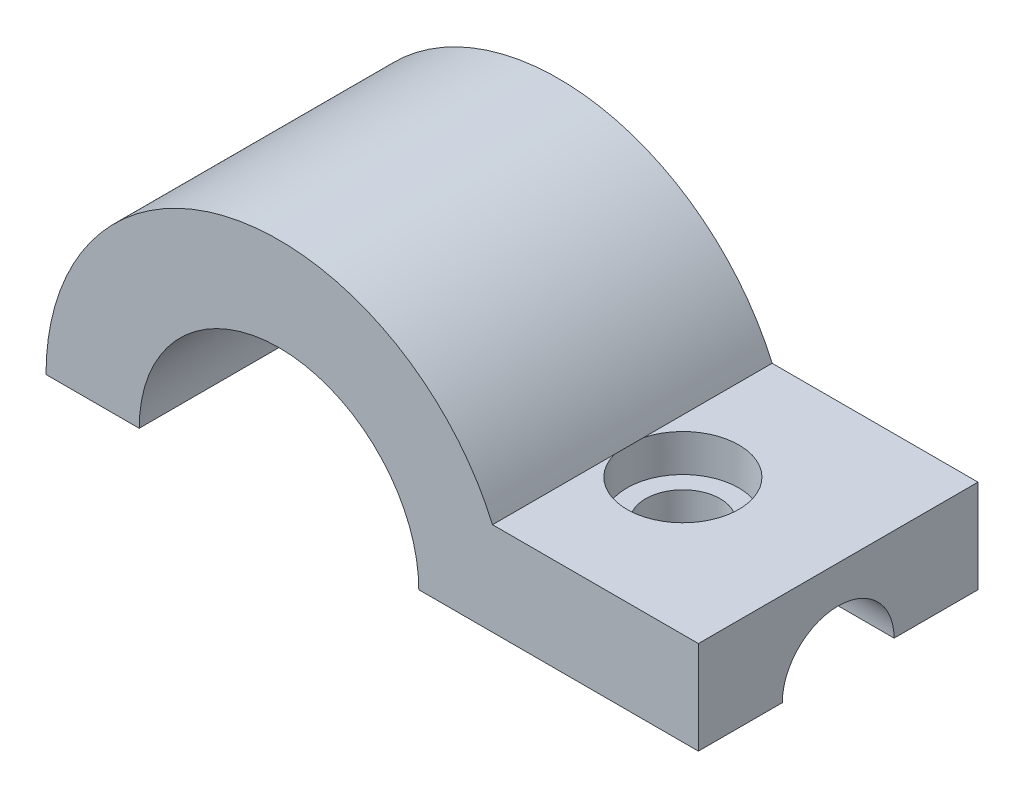
ISO-10303-21;
HEADER;
FILE_DESCRIPTION(('STEP AP214'),'2;1');
FILE_NAME('part.step','',(''),(''),'','','');
FILE_SCHEMA(('AUTOMOTIVE_DESIGN { 1 0 10303 214 1 1 1 1 }'));
ENDSEC;
DATA;
#1=APPLICATION_CONTEXT('core data for automotive mechanical design processes');
#2=APPLICATION_PROTOCOL_DEFINITION('international standard','automotive_design',2000,#1);
#3=PRODUCT_CONTEXT('',#1,'mechanical');
#4=PRODUCT('Part','Part','',(#3));
#5=PRODUCT_RELATED_PRODUCT_CATEGORY('part','',(#4));
#6=PRODUCT_DEFINITION_FORMATION('','',#4);
#7=PRODUCT_DEFINITION_CONTEXT('part definition',#1,'design');
#8=PRODUCT_DEFINITION('design','',#6,#7);
#9=PRODUCT_DEFINITION_SHAPE('','',#8);
#10=(LENGTH_UNIT() NAMED_UNIT(*) SI_UNIT(.MILLI.,.METRE.));
#11=(NAMED_UNIT(*) PLANE_ANGLE_UNIT() SI_UNIT($,.RADIAN.));
#12=(NAMED_UNIT(*) SI_UNIT($,.STERADIAN.) SOLID_ANGLE_UNIT());
#13=UNCERTAINTY_MEASURE_WITH_UNIT(LENGTH_MEASURE(1.E-05),#10,'distance_accuracy_value','');
#14=(GEOMETRIC_REPRESENTATION_CONTEXT(3) GLOBAL_UNCERTAINTY_ASSIGNED_CONTEXT((#13)) GLOBAL_UNIT_ASSIGNED_CONTEXT((#10,
#11,#12)) REPRESENTATION_CONTEXT('',''));
#15=CARTESIAN_POINT('',(0.,0.,0.));
#16=DIRECTION('',(0.,0.,1.));
#17=DIRECTION('',(1.,0.,0.));
#18=AXIS2_PLACEMENT_3D('',#15,#16,#17);
#19=CARTESIAN_POINT('',(-8.56480931815895,-1.,-0.731541815298442));
#20=DIRECTION('',(0.,1.,0.));
#21=DIRECTION('',(-1.,0.,0.));
#22=AXIS2_PLACEMENT_3D('',#19,#20,#21);
#23=CYLINDRICAL_SURFACE('',#22,0.200000000000001);
#24=CARTESIAN_POINT('',(-8.56480931815895,0.,-0.731541815298442));
#25=DIRECTION('',(0.,-1.,0.));
#26=DIRECTION('',(1.,0.,0.));
#27=AXIS2_PLACEMENT_3D('',#24,#25,#26);
#28=CIRCLE('',#27,0.200000000000001);
#29=CARTESIAN_POINT('',(-8.36480931815895,0.,-0.731541815298442));
#30=VERTEX_POINT('',#29);
#31=EDGE_CURVE('E138',#30,#30,#28,.T.);
#32=ORIENTED_EDGE('',*,*,#31,.T.);
#33=EDGE_LOOP('',(#32));
#34=FACE_BOUND('',#33,.T.);
#35=CARTESIAN_POINT('',(-8.56480931815895,0.3,-0.731541815298442));
#36=DIRECTION('',(0.,1.,0.));
#37=DIRECTION('',(-1.,0.,0.));
#38=AXIS2_PLACEMENT_3D('',#35,#36,#37);
#39=CIRCLE('',#38,0.200000000000001);
#40=CARTESIAN_POINT('',(-8.76480931815895,0.3,-0.731541815298442));
#41=VERTEX_POINT('',#40);
#42=EDGE_CURVE('E35',#41,#41,#39,.F.);
#43=ORIENTED_EDGE('',*,*,#42,.F.);
#44=EDGE_LOOP('',(#43));
#45=FACE_BOUND('',#44,.T.);
#46=ADVANCED_FACE('F31',(#34,#45),#23,.F.);
#47=CARTESIAN_POINT('',(-9.99999999999999,0.,-1.5));
#48=DIRECTION('',(0.,0.,1.));
#49=DIRECTION('',(1.,0.,0.));
#50=AXIS2_PLACEMENT_3D('',#47,#48,#49);
#51=CYLINDRICAL_SURFACE('',#50,0.750000000000001);
#52=CARTESIAN_POINT('',(-9.99999999999999,0.,0.));
#53=DIRECTION('',(0.,0.,-1.));
#54=DIRECTION('',(1.,0.,0.));
#55=AXIS2_PLACEMENT_3D('',#52,#53,#54);
#56=CIRCLE('',#55,0.750000000000001);
#57=CARTESIAN_POINT('',(-10.75,0.,0.));
#58=VERTEX_POINT('',#57);
#59=CARTESIAN_POINT('',(-9.24999999999999,0.,0.));
#60=VERTEX_POINT('',#59);
#61=EDGE_CURVE('E141',#58,#60,#56,.T.);
#62=ORIENTED_EDGE('',*,*,#61,.F.);
#63=DIRECTION('',(0.,0.,1.));
#64=VECTOR('',#63,1.);
#65=CARTESIAN_POINT('',(-10.75,0.,-1.5));
#66=LINE('',#65,#64);
#67=CARTESIAN_POINT('',(-10.75,0.,-1.5));
#68=VERTEX_POINT('',#67);
#69=EDGE_CURVE('E125',#68,#58,#66,.T.);
#70=ORIENTED_EDGE('',*,*,#69,.F.);
#71=CARTESIAN_POINT('',(-9.99999999999999,0.,-1.5));
#72=DIRECTION('',(0.,0.,-1.));
#73=DIRECTION('',(1.,0.,0.));
#74=AXIS2_PLACEMENT_3D('',#71,#72,#73);
#75=CIRCLE('',#74,0.750000000000001);
#76=CARTESIAN_POINT('',(-9.24999999999999,0.,-1.5));
#77=VERTEX_POINT('',#76);
#78=EDGE_CURVE('E267',#68,#77,#75,.T.);
#79=ORIENTED_EDGE('',*,*,#78,.T.);
#80=DIRECTION('',(0.,0.,1.));
#81=VECTOR('',#80,1.);
#82=CARTESIAN_POINT('',(-9.24999999999999,0.,-1.5));
#83=LINE('',#82,#81);
#84=EDGE_CURVE('E135',#77,#60,#83,.T.);
#85=ORIENTED_EDGE('',*,*,#84,.T.);
#86=EDGE_LOOP('',(#62,#70,#79,#85));
#87=FACE_BOUND('',#86,.T.);
#88=ADVANCED_FACE('F33',(#87),#51,.F.);
#89=CARTESIAN_POINT('',(-11.25,0.,-1.5));
#90=DIRECTION('',(0.,-1.,0.));
#91=DIRECTION('',(1.,0.,0.));
#92=AXIS2_PLACEMENT_3D('',#89,#90,#91);
#93=PLANE('',#92);
#94=DIRECTION('',(1.,0.,0.));
#95=VECTOR('',#94,1.);
#96=CARTESIAN_POINT('',(-11.25,0.,0.));
#97=LINE('',#96,#95);
#98=CARTESIAN_POINT('',(-11.25,0.,0.));
#99=VERTEX_POINT('',#98);
#100=EDGE_CURVE('E271',#99,#58,#97,.T.);
#101=ORIENTED_EDGE('',*,*,#100,.F.);
#102=DIRECTION('',(0.,0.,1.));
#103=VECTOR('',#102,1.);
#104=CARTESIAN_POINT('',(-11.25,0.,-1.5));
#105=LINE('',#104,#103);
#106=CARTESIAN_POINT('',(-11.25,0.,-1.5));
#107=VERTEX_POINT('',#106);
#108=EDGE_CURVE('E123',#107,#99,#105,.T.);
#109=ORIENTED_EDGE('',*,*,#108,.F.);
#110=DIRECTION('',(1.,0.,0.));
#111=VECTOR('',#110,1.);
#112=CARTESIAN_POINT('',(-11.25,0.,-1.5));
#113=LINE('',#112,#111);
#114=EDGE_CURVE('E137',#107,#68,#113,.T.);
#115=ORIENTED_EDGE('',*,*,#114,.T.);
#116=ORIENTED_EDGE('',*,*,#69,.T.);
#117=EDGE_LOOP('',(#101,#109,#115,#116));
#118=FACE_BOUND('',#117,.T.);
#119=ADVANCED_FACE('F174',(#118),#93,.T.);
#120=CARTESIAN_POINT('',(-9.99999999999999,0.,-1.5));
#121=DIRECTION('',(0.,0.,1.));
#122=DIRECTION('',(1.,0.,0.));
#123=AXIS2_PLACEMENT_3D('',#120,#121,#122);
#124=CYLINDRICAL_SURFACE('',#123,1.25);
#125=CARTESIAN_POINT('',(-9.99999999999999,0.,0.));
#126=DIRECTION('',(0.,0.,1.));
#127=DIRECTION('',(1.,0.,0.));
#128=AXIS2_PLACEMENT_3D('',#125,#126,#127);
#129=CIRCLE('',#128,1.25);
#130=CARTESIAN_POINT('',(-8.85435607626104,0.499999999999999,0.));
#131=VERTEX_POINT('',#130);
#132=EDGE_CURVE('E293',#131,#99,#129,.T.);
#133=ORIENTED_EDGE('',*,*,#132,.F.);
#134=DIRECTION('',(0.,0.,1.));
#135=VECTOR('',#134,1.);
#136=CARTESIAN_POINT('',(-8.85435607626104,0.499999999999999,-1.5));
#137=LINE('',#136,#135);
#138=CARTESIAN_POINT('',(-8.85435607626104,0.5,-0.653039109150367));
#139=VERTEX_POINT('',#138);
#140=EDGE_CURVE('E117',#139,#131,#137,.T.);
#141=ORIENTED_EDGE('',*,*,#140,.F.);
#142=DIRECTION('',(0.,0.,1.));
#143=VECTOR('',#142,1.);
#144=CARTESIAN_POINT('',(-8.85435607626104,0.5,-1.5));
#145=LINE('',#144,#143);
#146=CARTESIAN_POINT('',(-8.85435607626104,0.5,-0.810044521446517));
#147=VERTEX_POINT('',#146);
#148=EDGE_CURVE('E102',#147,#139,#145,.T.);
#149=ORIENTED_EDGE('',*,*,#148,.F.);
#150=CARTESIAN_POINT('',(-8.85435607626104,0.499999999999999,-1.5));
#151=VERTEX_POINT('',#150);
#152=EDGE_CURVE('E115',#151,#147,#137,.T.);
#153=ORIENTED_EDGE('',*,*,#152,.F.);
#154=CARTESIAN_POINT('',(-9.99999999999999,0.,-1.5));
#155=DIRECTION('',(0.,0.,1.));
#156=DIRECTION('',(1.,0.,0.));
#157=AXIS2_PLACEMENT_3D('',#154,#155,#156);
#158=CIRCLE('',#157,1.25);
#159=EDGE_CURVE('E278',#151,#107,#158,.T.);
#160=ORIENTED_EDGE('',*,*,#159,.T.);
#161=ORIENTED_EDGE('',*,*,#108,.T.);
#162=EDGE_LOOP('',(#133,#141,#149,#153,#160,#161));
#163=FACE_BOUND('',#162,.T.);
#164=ADVANCED_FACE('F113',(#163),#124,.T.);
#165=CARTESIAN_POINT('',(-7.74999999999999,0.5,-1.5));
#166=DIRECTION('',(0.,1.,0.));
#167=DIRECTION('',(-1.,0.,0.));
#168=AXIS2_PLACEMENT_3D('',#165,#166,#167);
#169=PLANE('',#168);
#170=CARTESIAN_POINT('',(-8.56480931815895,0.5,-0.731541815298442));
#171=DIRECTION('',(0.,1.,0.));
#172=DIRECTION('',(-1.,0.,0.));
#173=AXIS2_PLACEMENT_3D('',#170,#171,#172);
#174=CIRCLE('',#173,0.3);
#175=EDGE_CURVE('E104',#139,#147,#174,.T.);
#176=ORIENTED_EDGE('',*,*,#175,.F.);
#177=ORIENTED_EDGE('',*,*,#140,.T.);
#178=DIRECTION('',(-1.,0.,0.));
#179=VECTOR('',#178,1.);
#180=CARTESIAN_POINT('',(-7.74999999999999,0.5,0.));
#181=LINE('',#180,#179);
#182=CARTESIAN_POINT('',(-7.74999999999999,0.5,0.));
#183=VERTEX_POINT('',#182);
#184=EDGE_CURVE('E290',#183,#131,#181,.T.);
#185=ORIENTED_EDGE('',*,*,#184,.F.);
#186=DIRECTION('',(0.,0.,1.));
#187=VECTOR('',#186,1.);
#188=CARTESIAN_POINT('',(-7.74999999999999,0.5,-1.5));
#189=LINE('',#188,#187);
#190=CARTESIAN_POINT('',(-7.74999999999999,0.5,-1.5));
#191=VERTEX_POINT('',#190);
#192=EDGE_CURVE('E127',#191,#183,#189,.T.);
#193=ORIENTED_EDGE('',*,*,#192,.F.);
#194=DIRECTION('',(-1.,0.,0.));
#195=VECTOR('',#194,1.);
#196=CARTESIAN_POINT('',(-7.74999999999999,0.5,-1.5));
#197=LINE('',#196,#195);
#198=EDGE_CURVE('E122',#191,#151,#197,.T.);
#199=ORIENTED_EDGE('',*,*,#198,.T.);
#200=ORIENTED_EDGE('',*,*,#152,.T.);
#201=EDGE_LOOP('',(#176,#177,#185,#193,#199,#200));
#202=FACE_BOUND('',#201,.T.);
#203=ADVANCED_FACE('F120',(#202),#169,.T.);
#204=CARTESIAN_POINT('',(-7.74999999999999,0.,-1.5));
#205=DIRECTION('',(1.,0.,0.));
#206=DIRECTION('',(0.,0.,-1.));
#207=AXIS2_PLACEMENT_3D('',#204,#205,#206);
#208=PLANE('',#207);
#209=CARTESIAN_POINT('',(-7.74999999999999,0.,-0.75));
#210=DIRECTION('',(1.,0.,0.));
#211=DIRECTION('',(0.,0.,-1.));
#212=AXIS2_PLACEMENT_3D('',#209,#210,#211);
#213=CIRCLE('',#212,0.3);
#214=CARTESIAN_POINT('',(-7.74999999999999,0.,-1.05));
#215=VERTEX_POINT('',#214);
#216=CARTESIAN_POINT('',(-7.74999999999999,0.,-0.45));
#217=VERTEX_POINT('',#216);
#218=EDGE_CURVE('E150',#215,#217,#213,.T.);
#219=ORIENTED_EDGE('',*,*,#218,.F.);
#220=DIRECTION('',(0.,0.,1.));
#221=VECTOR('',#220,1.);
#222=CARTESIAN_POINT('',(-7.74999999999999,0.,-1.5));
#223=LINE('',#222,#221);
#224=CARTESIAN_POINT('',(-7.74999999999999,0.,-1.5));
#225=VERTEX_POINT('',#224);
#226=EDGE_CURVE('E131',#225,#215,#223,.T.);
#227=ORIENTED_EDGE('',*,*,#226,.F.);
#228=DIRECTION('',(0.,1.,0.));
#229=VECTOR('',#228,1.);
#230=CARTESIAN_POINT('',(-7.74999999999999,0.,-1.5));
#231=LINE('',#230,#229);
#232=EDGE_CURVE('E274',#225,#191,#231,.T.);
#233=ORIENTED_EDGE('',*,*,#232,.T.);
#234=ORIENTED_EDGE('',*,*,#192,.T.);
#235=DIRECTION('',(0.,1.,0.));
#236=VECTOR('',#235,1.);
#237=CARTESIAN_POINT('',(-7.74999999999999,0.,0.));
#238=LINE('',#237,#236);
#239=CARTESIAN_POINT('',(-7.74999999999999,0.,0.));
#240=VERTEX_POINT('',#239);
#241=EDGE_CURVE('E287',#240,#183,#238,.T.);
#242=ORIENTED_EDGE('',*,*,#241,.F.);
#243=EDGE_CURVE('E134',#217,#240,#223,.T.);
#244=ORIENTED_EDGE('',*,*,#243,.F.);
#245=EDGE_LOOP('',(#219,#227,#233,#234,#242,#244));
#246=FACE_BOUND('',#245,.T.);
#247=ADVANCED_FACE('F192',(#246),#208,.T.);
#248=CARTESIAN_POINT('',(-9.24999999999999,0.,-1.5));
#249=DIRECTION('',(0.,-1.,0.));
#250=DIRECTION('',(1.,0.,0.));
#251=AXIS2_PLACEMENT_3D('',#248,#249,#250);
#252=PLANE('',#251);
#253=DIRECTION('',(1.,0.,0.));
#254=VECTOR('',#253,1.);
#255=CARTESIAN_POINT('',(-8.24999999999999,0.,-1.05));
#256=LINE('',#255,#254);
#257=CARTESIAN_POINT('',(-8.24999999999999,0.,-1.05));
#258=VERTEX_POINT('',#257);
#259=EDGE_CURVE('E11',#258,#215,#256,.T.);
#260=ORIENTED_EDGE('',*,*,#259,.F.);
#261=DIRECTION('',(0.,0.,1.));
#262=VECTOR('',#261,1.);
#263=CARTESIAN_POINT('',(-8.24999999999999,0.,-1.5));
#264=LINE('',#263,#262);
#265=CARTESIAN_POINT('',(-8.24999999999999,0.,-0.45));
#266=VERTEX_POINT('',#265);
#267=EDGE_CURVE('E142',#258,#266,#264,.T.);
#268=ORIENTED_EDGE('',*,*,#267,.T.);
#269=DIRECTION('',(1.,0.,0.));
#270=VECTOR('',#269,1.);
#271=CARTESIAN_POINT('',(-8.24999999999999,0.,-0.45));
#272=LINE('',#271,#270);
#273=EDGE_CURVE('E40',#217,#266,#272,.F.);
#274=ORIENTED_EDGE('',*,*,#273,.F.);
#275=ORIENTED_EDGE('',*,*,#243,.T.);
#276=DIRECTION('',(1.,0.,0.));
#277=VECTOR('',#276,1.);
#278=CARTESIAN_POINT('',(-9.24999999999999,0.,0.));
#279=LINE('',#278,#277);
#280=EDGE_CURVE('E284',#60,#240,#279,.T.);
#281=ORIENTED_EDGE('',*,*,#280,.F.);
#282=ORIENTED_EDGE('',*,*,#84,.F.);
#283=DIRECTION('',(1.,0.,0.));
#284=VECTOR('',#283,1.);
#285=CARTESIAN_POINT('',(-9.24999999999999,0.,-1.5));
#286=LINE('',#285,#284);
#287=EDGE_CURVE('E270',#77,#225,#286,.T.);
#288=ORIENTED_EDGE('',*,*,#287,.T.);
#289=ORIENTED_EDGE('',*,*,#226,.T.);
#290=EDGE_LOOP('',(#260,#268,#274,#275,#281,#282,#288,#289));
#291=FACE_BOUND('',#290,.T.);
#292=ORIENTED_EDGE('',*,*,#31,.F.);
#293=EDGE_LOOP('',(#292));
#294=FACE_BOUND('',#293,.T.);
#295=ADVANCED_FACE('F153',(#291,#294),#252,.T.);
#296=CARTESIAN_POINT('',(-9.99999999999999,0.,-1.5));
#297=DIRECTION('',(0.,0.,1.));
#298=DIRECTION('',(1.,0.,0.));
#299=AXIS2_PLACEMENT_3D('',#296,#297,#298);
#300=PLANE('',#299);
#301=ORIENTED_EDGE('',*,*,#78,.F.);
#302=ORIENTED_EDGE('',*,*,#114,.F.);
#303=ORIENTED_EDGE('',*,*,#159,.F.);
#304=ORIENTED_EDGE('',*,*,#198,.F.);
#305=ORIENTED_EDGE('',*,*,#232,.F.);
#306=ORIENTED_EDGE('',*,*,#287,.F.);
#307=EDGE_LOOP('',(#301,#302,#303,#304,#305,#306));
#308=FACE_BOUND('',#307,.T.);
#309=ADVANCED_FACE('F178',(#308),#300,.F.);
#310=CARTESIAN_POINT('',(-9.99999999999999,0.,0.));
#311=DIRECTION('',(0.,0.,1.));
#312=DIRECTION('',(1.,0.,0.));
#313=AXIS2_PLACEMENT_3D('',#310,#311,#312);
#314=PLANE('',#313);
#315=ORIENTED_EDGE('',*,*,#61,.T.);
#316=ORIENTED_EDGE('',*,*,#280,.T.);
#317=ORIENTED_EDGE('',*,*,#241,.T.);
#318=ORIENTED_EDGE('',*,*,#184,.T.);
#319=ORIENTED_EDGE('',*,*,#132,.T.);
#320=ORIENTED_EDGE('',*,*,#100,.T.);
#321=EDGE_LOOP('',(#315,#316,#317,#318,#319,#320));
#322=FACE_BOUND('',#321,.T.);
#323=ADVANCED_FACE('F165',(#322),#314,.T.);
#324=CARTESIAN_POINT('',(-8.24999999999999,0.,-0.75));
#325=DIRECTION('',(1.,0.,0.));
#326=DIRECTION('',(0.,0.,-1.));
#327=AXIS2_PLACEMENT_3D('',#324,#325,#326);
#328=CYLINDRICAL_SURFACE('',#327,0.3);
#329=ORIENTED_EDGE('',*,*,#259,.T.);
#330=ORIENTED_EDGE('',*,*,#218,.T.);
#331=ORIENTED_EDGE('',*,*,#273,.T.);
#332=CARTESIAN_POINT('',(-8.24999999999999,0.,-0.75));
#333=DIRECTION('',(1.,0.,0.));
#334=DIRECTION('',(0.,0.,-1.));
#335=AXIS2_PLACEMENT_3D('',#332,#333,#334);
#336=CIRCLE('',#335,0.3);
#337=EDGE_CURVE('E53',#258,#266,#336,.T.);
#338=ORIENTED_EDGE('',*,*,#337,.F.);
#339=EDGE_LOOP('',(#329,#330,#331,#338));
#340=FACE_BOUND('',#339,.T.);
#341=ADVANCED_FACE('F147',(#340),#328,.F.);
#342=CARTESIAN_POINT('',(-8.24999999999999,0.,-0.75));
#343=DIRECTION('',(1.,0.,0.));
#344=DIRECTION('',(0.,0.,-1.));
#345=AXIS2_PLACEMENT_3D('',#342,#343,#344);
#346=PLANE('',#345);
#347=ORIENTED_EDGE('',*,*,#337,.T.);
#348=ORIENTED_EDGE('',*,*,#267,.F.);
#349=EDGE_LOOP('',(#347,#348));
#350=FACE_BOUND('',#349,.T.);
#351=ADVANCED_FACE('F155',(#350),#346,.T.);
#352=CARTESIAN_POINT('',(-8.56480931815895,0.3,-0.731541815298442));
#353=DIRECTION('',(0.,1.,0.));
#354=DIRECTION('',(-1.,0.,0.));
#355=AXIS2_PLACEMENT_3D('',#352,#353,#354);
#356=PLANE('',#355);
#357=CARTESIAN_POINT('',(-8.56480931815895,0.3,-0.731541815298442));
#358=DIRECTION('',(0.,1.,0.));
#359=DIRECTION('',(-1.,0.,0.));
#360=AXIS2_PLACEMENT_3D('',#357,#358,#359);
#361=CIRCLE('',#360,0.3);
#362=CARTESIAN_POINT('',(-8.86480931815895,0.3,-0.731541815298442));
#363=VERTEX_POINT('',#362);
#364=EDGE_CURVE('E110',#363,#363,#361,.T.);
#365=ORIENTED_EDGE('',*,*,#364,.T.);
#366=EDGE_LOOP('',(#365));
#367=FACE_BOUND('',#366,.T.);
#368=ORIENTED_EDGE('',*,*,#42,.T.);
#369=EDGE_LOOP('',(#368));
#370=FACE_BOUND('',#369,.T.);
#371=ADVANCED_FACE('F157',(#367,#370),#356,.T.);
#372=CARTESIAN_POINT('',(-8.56480931815895,0.5,-0.731541815298442));
#373=DIRECTION('',(0.,1.,0.));
#374=DIRECTION('',(-1.,0.,0.));
#375=AXIS2_PLACEMENT_3D('',#372,#373,#374);
#376=PLANE('',#375);
#377=ORIENTED_EDGE('',*,*,#148,.T.);
#378=EDGE_CURVE('E46',#147,#139,#174,.T.);
#379=ORIENTED_EDGE('',*,*,#378,.F.);
#380=EDGE_LOOP('',(#377,#379));
#381=FACE_BOUND('',#380,.T.);
#382=ADVANCED_FACE('F100',(#381),#376,.F.);
#383=CARTESIAN_POINT('',(-8.56480931815895,0.3,-0.731541815298442));
#384=DIRECTION('',(0.,1.,0.));
#385=DIRECTION('',(-1.,0.,0.));
#386=AXIS2_PLACEMENT_3D('',#383,#384,#385);
#387=CYLINDRICAL_SURFACE('',#386,0.3);
#388=ORIENTED_EDGE('',*,*,#364,.F.);
#389=EDGE_LOOP('',(#388));
#390=FACE_BOUND('',#389,.T.);
#391=ORIENTED_EDGE('',*,*,#175,.T.);
#392=ORIENTED_EDGE('',*,*,#378,.T.);
#393=EDGE_LOOP('',(#391,#392));
#394=FACE_BOUND('',#393,.T.);
#395=ADVANCED_FACE('F106',(#390,#394),#387,.F.);
#396=CLOSED_SHELL('',(#46,#88,#119,#164,#203,#247,#295,#309,#323,#341,#351,#371,#382,#395));
#397=MANIFOLD_SOLID_BREP('B2',#396);
#398=ADVANCED_BREP_SHAPE_REPRESENTATION('',(#18,#397),#14);
#399=SHAPE_DEFINITION_REPRESENTATION(#9,#398);
ENDSEC;
END-ISO-10303-21;
